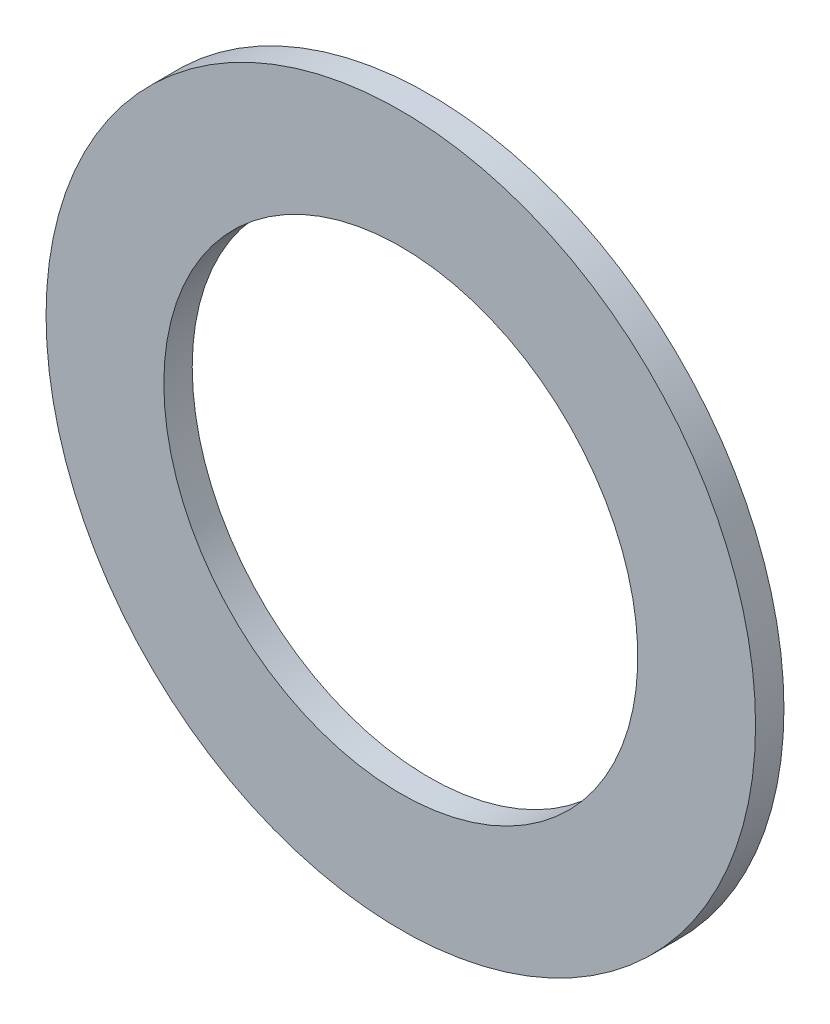
ISO-10303-21;
HEADER;
FILE_DESCRIPTION(('STEP AP214'),'2;1');
FILE_NAME('part.step','',(''),(''),'','','');
FILE_SCHEMA(('AUTOMOTIVE_DESIGN { 1 0 10303 214 1 1 1 1 }'));
ENDSEC;
DATA;
#1=APPLICATION_CONTEXT('core data for automotive mechanical design processes');
#2=APPLICATION_PROTOCOL_DEFINITION('international standard','automotive_design',2000,#1);
#3=PRODUCT_CONTEXT('',#1,'mechanical');
#4=PRODUCT('Part','Part','',(#3));
#5=PRODUCT_RELATED_PRODUCT_CATEGORY('part','',(#4));
#6=PRODUCT_DEFINITION_FORMATION('','',#4);
#7=PRODUCT_DEFINITION_CONTEXT('part definition',#1,'design');
#8=PRODUCT_DEFINITION('design','',#6,#7);
#9=PRODUCT_DEFINITION_SHAPE('','',#8);
#10=(LENGTH_UNIT() NAMED_UNIT(*) SI_UNIT(.MILLI.,.METRE.));
#11=(NAMED_UNIT(*) PLANE_ANGLE_UNIT() SI_UNIT($,.RADIAN.));
#12=(NAMED_UNIT(*) SI_UNIT($,.STERADIAN.) SOLID_ANGLE_UNIT());
#13=UNCERTAINTY_MEASURE_WITH_UNIT(LENGTH_MEASURE(1.E-05),#10,'distance_accuracy_value','');
#14=(GEOMETRIC_REPRESENTATION_CONTEXT(3) GLOBAL_UNCERTAINTY_ASSIGNED_CONTEXT((#13)) GLOBAL_UNIT_ASSIGNED_CONTEXT((#10,
#11,#12)) REPRESENTATION_CONTEXT('',''));
#15=CARTESIAN_POINT('',(0.,0.,0.));
#16=DIRECTION('',(0.,0.,1.));
#17=DIRECTION('',(1.,0.,0.));
#18=AXIS2_PLACEMENT_3D('',#15,#16,#17);
#19=CARTESIAN_POINT('',(0.,0.,-0.381));
#20=DIRECTION('',(0.,0.,1.));
#21=DIRECTION('',(1.,0.,0.));
#22=AXIS2_PLACEMENT_3D('',#19,#20,#21);
#23=PLANE('',#22);
#24=CARTESIAN_POINT('',(0.,0.,-0.381));
#25=DIRECTION('',(0.,0.,-1.));
#26=DIRECTION('',(-1.,0.,0.));
#27=AXIS2_PLACEMENT_3D('',#24,#25,#26);
#28=CIRCLE('',#27,6.3627);
#29=CARTESIAN_POINT('',(-6.3627,0.,-0.381));
#30=VERTEX_POINT('',#29);
#31=EDGE_CURVE('E26',#30,#30,#28,.F.);
#32=ORIENTED_EDGE('',*,*,#31,.T.);
#33=EDGE_LOOP('',(#32));
#34=FACE_BOUND('',#33,.T.);
#35=CARTESIAN_POINT('',(0.,0.,-0.381));
#36=DIRECTION('',(0.,0.,-1.));
#37=DIRECTION('',(-1.,0.,0.));
#38=AXIS2_PLACEMENT_3D('',#35,#36,#37);
#39=CIRCLE('',#38,9.525);
#40=CARTESIAN_POINT('',(-9.525,0.,-0.381));
#41=VERTEX_POINT('',#40);
#42=EDGE_CURVE('E17',#41,#41,#39,.F.);
#43=ORIENTED_EDGE('',*,*,#42,.F.);
#44=EDGE_LOOP('',(#43));
#45=FACE_BOUND('',#44,.T.);
#46=ADVANCED_FACE('F14',(#34,#45),#23,.F.);
#47=CARTESIAN_POINT('',(0.,0.,0.381));
#48=DIRECTION('',(0.,0.,-1.));
#49=DIRECTION('',(-1.,0.,0.));
#50=AXIS2_PLACEMENT_3D('',#47,#48,#49);
#51=CYLINDRICAL_SURFACE('',#50,9.525);
#52=ORIENTED_EDGE('',*,*,#42,.T.);
#53=EDGE_LOOP('',(#52));
#54=FACE_BOUND('',#53,.T.);
#55=CARTESIAN_POINT('',(0.,0.,0.381));
#56=DIRECTION('',(0.,0.,-1.));
#57=DIRECTION('',(-1.,0.,0.));
#58=AXIS2_PLACEMENT_3D('',#55,#56,#57);
#59=CIRCLE('',#58,9.525);
#60=CARTESIAN_POINT('',(-9.525,0.,0.381));
#61=VERTEX_POINT('',#60);
#62=EDGE_CURVE('E21',#61,#61,#59,.F.);
#63=ORIENTED_EDGE('',*,*,#62,.F.);
#64=EDGE_LOOP('',(#63));
#65=FACE_BOUND('',#64,.T.);
#66=ADVANCED_FACE('F34',(#54,#65),#51,.T.);
#67=CARTESIAN_POINT('',(0.,0.,0.381));
#68=DIRECTION('',(0.,0.,-1.));
#69=DIRECTION('',(-1.,0.,0.));
#70=AXIS2_PLACEMENT_3D('',#67,#68,#69);
#71=CYLINDRICAL_SURFACE('',#70,6.3627);
#72=CARTESIAN_POINT('',(0.,0.,0.381));
#73=DIRECTION('',(0.,0.,-1.));
#74=DIRECTION('',(-1.,0.,0.));
#75=AXIS2_PLACEMENT_3D('',#72,#73,#74);
#76=CIRCLE('',#75,6.3627);
#77=CARTESIAN_POINT('',(-6.3627,0.,0.381));
#78=VERTEX_POINT('',#77);
#79=EDGE_CURVE('E10',#78,#78,#76,.T.);
#80=ORIENTED_EDGE('',*,*,#79,.F.);
#81=EDGE_LOOP('',(#80));
#82=FACE_BOUND('',#81,.T.);
#83=ORIENTED_EDGE('',*,*,#31,.F.);
#84=EDGE_LOOP('',(#83));
#85=FACE_BOUND('',#84,.T.);
#86=ADVANCED_FACE('F42',(#82,#85),#71,.F.);
#87=CARTESIAN_POINT('',(0.,0.,0.381));
#88=DIRECTION('',(0.,0.,1.));
#89=DIRECTION('',(1.,0.,0.));
#90=AXIS2_PLACEMENT_3D('',#87,#88,#89);
#91=PLANE('',#90);
#92=ORIENTED_EDGE('',*,*,#79,.T.);
#93=EDGE_LOOP('',(#92));
#94=FACE_BOUND('',#93,.T.);
#95=ORIENTED_EDGE('',*,*,#62,.T.);
#96=EDGE_LOOP('',(#95));
#97=FACE_BOUND('',#96,.T.);
#98=ADVANCED_FACE('F43',(#94,#97),#91,.T.);
#99=CLOSED_SHELL('',(#46,#66,#86,#98));
#100=MANIFOLD_SOLID_BREP('B1',#99);
#101=ADVANCED_BREP_SHAPE_REPRESENTATION('',(#18,#100),#14);
#102=SHAPE_DEFINITION_REPRESENTATION(#9,#101);
ENDSEC;
END-ISO-10303-21;
